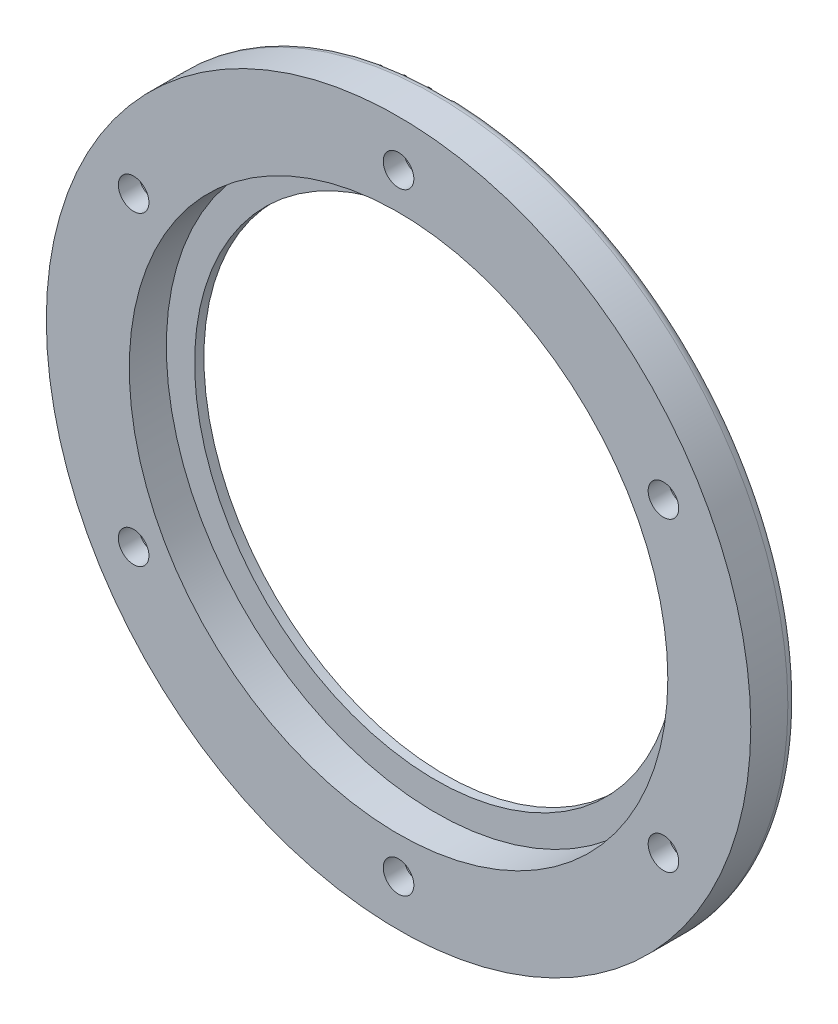
ISO-10303-21;
HEADER;
FILE_DESCRIPTION(('STEP AP214'),'2;1');
FILE_NAME('part.step','',(''),(''),'','','');
FILE_SCHEMA(('AUTOMOTIVE_DESIGN { 1 0 10303 214 1 1 1 1 }'));
ENDSEC;
DATA;
#1=APPLICATION_CONTEXT('core data for automotive mechanical design processes');
#2=APPLICATION_PROTOCOL_DEFINITION('international standard','automotive_design',2000,#1);
#3=PRODUCT_CONTEXT('',#1,'mechanical');
#4=PRODUCT('Part','Part','',(#3));
#5=PRODUCT_RELATED_PRODUCT_CATEGORY('part','',(#4));
#6=PRODUCT_DEFINITION_FORMATION('','',#4);
#7=PRODUCT_DEFINITION_CONTEXT('part definition',#1,'design');
#8=PRODUCT_DEFINITION('design','',#6,#7);
#9=PRODUCT_DEFINITION_SHAPE('','',#8);
#10=(LENGTH_UNIT() NAMED_UNIT(*) SI_UNIT(.MILLI.,.METRE.));
#11=(NAMED_UNIT(*) PLANE_ANGLE_UNIT() SI_UNIT($,.RADIAN.));
#12=(NAMED_UNIT(*) SI_UNIT($,.STERADIAN.) SOLID_ANGLE_UNIT());
#13=UNCERTAINTY_MEASURE_WITH_UNIT(LENGTH_MEASURE(1.E-05),#10,'distance_accuracy_value','');
#14=(GEOMETRIC_REPRESENTATION_CONTEXT(3) GLOBAL_UNCERTAINTY_ASSIGNED_CONTEXT((#13)) GLOBAL_UNIT_ASSIGNED_CONTEXT((#10,
#11,#12)) REPRESENTATION_CONTEXT('',''));
#15=CARTESIAN_POINT('',(0.,0.,0.));
#16=DIRECTION('',(0.,0.,1.));
#17=DIRECTION('',(1.,0.,0.));
#18=AXIS2_PLACEMENT_3D('',#15,#16,#17);
#19=CARTESIAN_POINT('',(28.5788383248865,-16.4999999999999,-24.));
#20=DIRECTION('',(0.,0.,-1.));
#21=DIRECTION('',(-1.,0.,0.));
#22=AXIS2_PLACEMENT_3D('',#19,#20,#21);
#23=CYLINDRICAL_SURFACE('',#22,1.65);
#24=CARTESIAN_POINT('',(28.5788383248865,-16.4999999999999,-24.));
#25=DIRECTION('',(0.,0.,-1.));
#26=DIRECTION('',(-1.,0.,0.));
#27=AXIS2_PLACEMENT_3D('',#24,#25,#26);
#28=CIRCLE('',#27,1.65);
#29=CARTESIAN_POINT('',(26.9288383248865,-16.4999999999999,-24.));
#30=VERTEX_POINT('',#29);
#31=EDGE_CURVE('E97',#30,#30,#28,.T.);
#32=ORIENTED_EDGE('',*,*,#31,.F.);
#33=EDGE_LOOP('',(#32));
#34=FACE_BOUND('',#33,.T.);
#35=CARTESIAN_POINT('',(28.5788383248865,-16.4999999999999,-26.2));
#36=DIRECTION('',(0.,0.,-1.));
#37=DIRECTION('',(-1.,0.,0.));
#38=AXIS2_PLACEMENT_3D('',#35,#36,#37);
#39=CIRCLE('',#38,1.65);
#40=CARTESIAN_POINT('',(26.9288383248865,-16.4999999999999,-26.2));
#41=VERTEX_POINT('',#40);
#42=EDGE_CURVE('E56',#41,#41,#39,.F.);
#43=ORIENTED_EDGE('',*,*,#42,.F.);
#44=EDGE_LOOP('',(#43));
#45=FACE_BOUND('',#44,.T.);
#46=ADVANCED_FACE('F38',(#34,#45),#23,.F.);
#47=CARTESIAN_POINT('',(28.5788383248864,16.5000000000001,-24.));
#48=DIRECTION('',(0.,0.,-1.));
#49=DIRECTION('',(-1.,0.,0.));
#50=AXIS2_PLACEMENT_3D('',#47,#48,#49);
#51=CYLINDRICAL_SURFACE('',#50,1.65);
#52=CARTESIAN_POINT('',(28.5788383248864,16.5000000000001,-24.));
#53=DIRECTION('',(0.,0.,-1.));
#54=DIRECTION('',(-1.,0.,0.));
#55=AXIS2_PLACEMENT_3D('',#52,#53,#54);
#56=CIRCLE('',#55,1.65);
#57=CARTESIAN_POINT('',(26.9288383248864,16.5000000000001,-24.));
#58=VERTEX_POINT('',#57);
#59=EDGE_CURVE('E94',#58,#58,#56,.T.);
#60=ORIENTED_EDGE('',*,*,#59,.F.);
#61=EDGE_LOOP('',(#60));
#62=FACE_BOUND('',#61,.T.);
#63=CARTESIAN_POINT('',(28.5788383248864,16.5000000000001,-26.2));
#64=DIRECTION('',(0.,0.,-1.));
#65=DIRECTION('',(-1.,0.,0.));
#66=AXIS2_PLACEMENT_3D('',#63,#64,#65);
#67=CIRCLE('',#66,1.65);
#68=CARTESIAN_POINT('',(26.9288383248864,16.5000000000001,-26.2));
#69=VERTEX_POINT('',#68);
#70=EDGE_CURVE('E60',#69,#69,#67,.F.);
#71=ORIENTED_EDGE('',*,*,#70,.F.);
#72=EDGE_LOOP('',(#71));
#73=FACE_BOUND('',#72,.T.);
#74=ADVANCED_FACE('F201',(#62,#73),#51,.F.);
#75=CARTESIAN_POINT('',(-2.30437768363647E-13,33.,-24.));
#76=DIRECTION('',(0.,0.,-1.));
#77=DIRECTION('',(-1.,0.,0.));
#78=AXIS2_PLACEMENT_3D('',#75,#76,#77);
#79=CYLINDRICAL_SURFACE('',#78,1.65);
#80=CARTESIAN_POINT('',(-2.30437768363647E-13,33.,-24.));
#81=DIRECTION('',(0.,0.,-1.));
#82=DIRECTION('',(-1.,0.,0.));
#83=AXIS2_PLACEMENT_3D('',#80,#81,#82);
#84=CIRCLE('',#83,1.65);
#85=CARTESIAN_POINT('',(-1.65000000000023,33.,-24.));
#86=VERTEX_POINT('',#85);
#87=EDGE_CURVE('E91',#86,#86,#84,.T.);
#88=ORIENTED_EDGE('',*,*,#87,.F.);
#89=EDGE_LOOP('',(#88));
#90=FACE_BOUND('',#89,.T.);
#91=CARTESIAN_POINT('',(-2.30437768363647E-13,33.,-26.2));
#92=DIRECTION('',(0.,0.,-1.));
#93=DIRECTION('',(-1.,0.,0.));
#94=AXIS2_PLACEMENT_3D('',#91,#92,#93);
#95=CIRCLE('',#94,1.65);
#96=CARTESIAN_POINT('',(-1.65000000000023,33.,-26.2));
#97=VERTEX_POINT('',#96);
#98=EDGE_CURVE('E63',#97,#97,#95,.F.);
#99=ORIENTED_EDGE('',*,*,#98,.F.);
#100=EDGE_LOOP('',(#99));
#101=FACE_BOUND('',#100,.T.);
#102=ADVANCED_FACE('F207',(#90,#101),#79,.F.);
#103=CARTESIAN_POINT('',(-28.5788383248866,16.4999999999997,-24.));
#104=DIRECTION('',(0.,0.,-1.));
#105=DIRECTION('',(-1.,0.,0.));
#106=AXIS2_PLACEMENT_3D('',#103,#104,#105);
#107=CYLINDRICAL_SURFACE('',#106,1.65);
#108=CARTESIAN_POINT('',(-28.5788383248866,16.4999999999997,-24.));
#109=DIRECTION('',(0.,0.,-1.));
#110=DIRECTION('',(-1.,0.,0.));
#111=AXIS2_PLACEMENT_3D('',#108,#109,#110);
#112=CIRCLE('',#111,1.65);
#113=CARTESIAN_POINT('',(-30.2288383248866,16.4999999999997,-24.));
#114=VERTEX_POINT('',#113);
#115=EDGE_CURVE('E88',#114,#114,#112,.T.);
#116=ORIENTED_EDGE('',*,*,#115,.F.);
#117=EDGE_LOOP('',(#116));
#118=FACE_BOUND('',#117,.T.);
#119=CARTESIAN_POINT('',(-28.5788383248866,16.4999999999997,-26.2));
#120=DIRECTION('',(0.,0.,-1.));
#121=DIRECTION('',(-1.,0.,0.));
#122=AXIS2_PLACEMENT_3D('',#119,#120,#121);
#123=CIRCLE('',#122,1.65);
#124=CARTESIAN_POINT('',(-30.2288383248866,16.4999999999997,-26.2));
#125=VERTEX_POINT('',#124);
#126=EDGE_CURVE('E66',#125,#125,#123,.F.);
#127=ORIENTED_EDGE('',*,*,#126,.F.);
#128=EDGE_LOOP('',(#127));
#129=FACE_BOUND('',#128,.T.);
#130=ADVANCED_FACE('F216',(#118,#129),#107,.F.);
#131=CARTESIAN_POINT('',(-28.5788383248863,-16.5000000000003,-24.));
#132=DIRECTION('',(0.,0.,-1.));
#133=DIRECTION('',(-1.,0.,0.));
#134=AXIS2_PLACEMENT_3D('',#131,#132,#133);
#135=CYLINDRICAL_SURFACE('',#134,1.65);
#136=CARTESIAN_POINT('',(-28.5788383248863,-16.5000000000003,-24.));
#137=DIRECTION('',(0.,0.,-1.));
#138=DIRECTION('',(-1.,0.,0.));
#139=AXIS2_PLACEMENT_3D('',#136,#137,#138);
#140=CIRCLE('',#139,1.65);
#141=CARTESIAN_POINT('',(-30.2288383248863,-16.5000000000003,-24.));
#142=VERTEX_POINT('',#141);
#143=EDGE_CURVE('E59',#142,#142,#140,.T.);
#144=ORIENTED_EDGE('',*,*,#143,.F.);
#145=EDGE_LOOP('',(#144));
#146=FACE_BOUND('',#145,.T.);
#147=CARTESIAN_POINT('',(-28.5788383248863,-16.5000000000003,-26.2));
#148=DIRECTION('',(0.,0.,-1.));
#149=DIRECTION('',(-1.,0.,0.));
#150=AXIS2_PLACEMENT_3D('',#147,#148,#149);
#151=CIRCLE('',#150,1.65);
#152=CARTESIAN_POINT('',(-30.2288383248863,-16.5000000000003,-26.2));
#153=VERTEX_POINT('',#152);
#154=EDGE_CURVE('E69',#153,#153,#151,.F.);
#155=ORIENTED_EDGE('',*,*,#154,.F.);
#156=EDGE_LOOP('',(#155));
#157=FACE_BOUND('',#156,.T.);
#158=ADVANCED_FACE('F197',(#146,#157),#135,.F.);
#159=CARTESIAN_POINT('',(0.,-33.,-24.));
#160=DIRECTION('',(0.,0.,-1.));
#161=DIRECTION('',(-1.,0.,0.));
#162=AXIS2_PLACEMENT_3D('',#159,#160,#161);
#163=CYLINDRICAL_SURFACE('',#162,1.65);
#164=CARTESIAN_POINT('',(0.,-33.,-24.));
#165=DIRECTION('',(0.,0.,-1.));
#166=DIRECTION('',(-1.,0.,0.));
#167=AXIS2_PLACEMENT_3D('',#164,#165,#166);
#168=CIRCLE('',#167,1.65);
#169=CARTESIAN_POINT('',(-1.65,-33.,-24.));
#170=VERTEX_POINT('',#169);
#171=EDGE_CURVE('E87',#170,#170,#168,.T.);
#172=ORIENTED_EDGE('',*,*,#171,.F.);
#173=EDGE_LOOP('',(#172));
#174=FACE_BOUND('',#173,.T.);
#175=CARTESIAN_POINT('',(0.,-33.,-26.2));
#176=DIRECTION('',(0.,0.,-1.));
#177=DIRECTION('',(-1.,0.,0.));
#178=AXIS2_PLACEMENT_3D('',#175,#176,#177);
#179=CIRCLE('',#178,1.65);
#180=CARTESIAN_POINT('',(-1.65,-33.,-26.2));
#181=VERTEX_POINT('',#180);
#182=EDGE_CURVE('E72',#181,#181,#179,.F.);
#183=ORIENTED_EDGE('',*,*,#182,.F.);
#184=EDGE_LOOP('',(#183));
#185=FACE_BOUND('',#184,.T.);
#186=ADVANCED_FACE('F193',(#174,#185),#163,.F.);
#187=CARTESIAN_POINT('',(0.,0.,-29.));
#188=DIRECTION('',(0.,0.,1.));
#189=DIRECTION('',(1.,0.,0.));
#190=AXIS2_PLACEMENT_3D('',#187,#188,#189);
#191=CYLINDRICAL_SURFACE('',#190,38.);
#192=CARTESIAN_POINT('',(0.,0.,-28.));
#193=DIRECTION('',(0.,0.,-1.));
#194=DIRECTION('',(-1.,0.,0.));
#195=AXIS2_PLACEMENT_3D('',#192,#193,#194);
#196=CIRCLE('',#195,38.);
#197=CARTESIAN_POINT('',(-38.,0.,-28.));
#198=VERTEX_POINT('',#197);
#199=EDGE_CURVE('E45',#198,#198,#196,.F.);
#200=ORIENTED_EDGE('',*,*,#199,.T.);
#201=EDGE_LOOP('',(#200));
#202=FACE_BOUND('',#201,.T.);
#203=CARTESIAN_POINT('',(0.,0.,-24.));
#204=DIRECTION('',(0.,0.,1.));
#205=DIRECTION('',(1.,0.,0.));
#206=AXIS2_PLACEMENT_3D('',#203,#204,#205);
#207=CIRCLE('',#206,38.);
#208=CARTESIAN_POINT('',(38.,0.,-24.));
#209=VERTEX_POINT('',#208);
#210=EDGE_CURVE('E49',#209,#209,#207,.T.);
#211=ORIENTED_EDGE('',*,*,#210,.F.);
#212=EDGE_LOOP('',(#211));
#213=FACE_BOUND('',#212,.T.);
#214=ADVANCED_FACE('F154',(#202,#213),#191,.T.);
#215=CARTESIAN_POINT('',(38.,0.,-29.));
#216=DIRECTION('',(0.,0.,-1.));
#217=DIRECTION('',(-1.,0.,0.));
#218=AXIS2_PLACEMENT_3D('',#215,#216,#217);
#219=PLANE('',#218);
#220=CARTESIAN_POINT('',(0.,0.,-29.));
#221=DIRECTION('',(0.,0.,-1.));
#222=DIRECTION('',(-1.,0.,0.));
#223=AXIS2_PLACEMENT_3D('',#220,#221,#222);
#224=CIRCLE('',#223,37.);
#225=CARTESIAN_POINT('',(-37.,0.,-29.));
#226=VERTEX_POINT('',#225);
#227=EDGE_CURVE('E10',#226,#226,#224,.T.);
#228=ORIENTED_EDGE('',*,*,#227,.T.);
#229=EDGE_LOOP('',(#228));
#230=FACE_BOUND('',#229,.T.);
#231=CARTESIAN_POINT('',(0.,-33.,-29.));
#232=DIRECTION('',(0.,0.,-1.));
#233=DIRECTION('',(-1.,0.,0.));
#234=AXIS2_PLACEMENT_3D('',#231,#232,#233);
#235=CIRCLE('',#234,3.);
#236=CARTESIAN_POINT('',(-3.,-33.,-29.));
#237=VERTEX_POINT('',#236);
#238=EDGE_CURVE('E129',#237,#237,#235,.T.);
#239=ORIENTED_EDGE('',*,*,#238,.F.);
#240=EDGE_LOOP('',(#239));
#241=FACE_BOUND('',#240,.T.);
#242=CARTESIAN_POINT('',(-28.5788383248863,-16.5000000000003,-29.));
#243=DIRECTION('',(0.,0.,-1.));
#244=DIRECTION('',(-1.,0.,0.));
#245=AXIS2_PLACEMENT_3D('',#242,#243,#244);
#246=CIRCLE('',#245,3.);
#247=CARTESIAN_POINT('',(-31.5788383248863,-16.5000000000003,-29.));
#248=VERTEX_POINT('',#247);
#249=EDGE_CURVE('E108',#248,#248,#246,.T.);
#250=ORIENTED_EDGE('',*,*,#249,.F.);
#251=EDGE_LOOP('',(#250));
#252=FACE_BOUND('',#251,.T.);
#253=CARTESIAN_POINT('',(-28.5788383248866,16.4999999999997,-29.));
#254=DIRECTION('',(0.,0.,-1.));
#255=DIRECTION('',(-1.,0.,0.));
#256=AXIS2_PLACEMENT_3D('',#253,#254,#255);
#257=CIRCLE('',#256,3.);
#258=CARTESIAN_POINT('',(-31.5788383248866,16.4999999999997,-29.));
#259=VERTEX_POINT('',#258);
#260=EDGE_CURVE('E107',#259,#259,#257,.T.);
#261=ORIENTED_EDGE('',*,*,#260,.F.);
#262=EDGE_LOOP('',(#261));
#263=FACE_BOUND('',#262,.T.);
#264=CARTESIAN_POINT('',(-2.30437768363647E-13,33.,-29.));
#265=DIRECTION('',(0.,0.,-1.));
#266=DIRECTION('',(-1.,0.,0.));
#267=AXIS2_PLACEMENT_3D('',#264,#265,#266);
#268=CIRCLE('',#267,3.);
#269=CARTESIAN_POINT('',(-3.00000000000023,33.,-29.));
#270=VERTEX_POINT('',#269);
#271=EDGE_CURVE('E114',#270,#270,#268,.T.);
#272=ORIENTED_EDGE('',*,*,#271,.F.);
#273=EDGE_LOOP('',(#272));
#274=FACE_BOUND('',#273,.T.);
#275=CARTESIAN_POINT('',(28.5788383248864,16.5000000000001,-29.));
#276=DIRECTION('',(0.,0.,-1.));
#277=DIRECTION('',(-1.,0.,0.));
#278=AXIS2_PLACEMENT_3D('',#275,#276,#277);
#279=CIRCLE('',#278,3.);
#280=CARTESIAN_POINT('',(25.5788383248864,16.5000000000001,-29.));
#281=VERTEX_POINT('',#280);
#282=EDGE_CURVE('E120',#281,#281,#279,.T.);
#283=ORIENTED_EDGE('',*,*,#282,.F.);
#284=EDGE_LOOP('',(#283));
#285=FACE_BOUND('',#284,.T.);
#286=CARTESIAN_POINT('',(28.5788383248865,-16.4999999999999,-29.));
#287=DIRECTION('',(0.,0.,-1.));
#288=DIRECTION('',(-1.,0.,0.));
#289=AXIS2_PLACEMENT_3D('',#286,#287,#288);
#290=CIRCLE('',#289,3.);
#291=CARTESIAN_POINT('',(25.5788383248865,-16.4999999999999,-29.));
#292=VERTEX_POINT('',#291);
#293=EDGE_CURVE('E126',#292,#292,#290,.T.);
#294=ORIENTED_EDGE('',*,*,#293,.F.);
#295=EDGE_LOOP('',(#294));
#296=FACE_BOUND('',#295,.T.);
#297=CARTESIAN_POINT('',(0.,0.,-29.));
#298=DIRECTION('',(0.,0.,1.));
#299=DIRECTION('',(1.,0.,0.));
#300=AXIS2_PLACEMENT_3D('',#297,#298,#299);
#301=CIRCLE('',#300,26.);
#302=CARTESIAN_POINT('',(26.,0.,-29.));
#303=VERTEX_POINT('',#302);
#304=EDGE_CURVE('E53',#303,#303,#301,.T.);
#305=ORIENTED_EDGE('',*,*,#304,.T.);
#306=EDGE_LOOP('',(#305));
#307=FACE_BOUND('',#306,.T.);
#308=ADVANCED_FACE('F150',(#230,#241,#252,#263,#274,#285,#296,#307),#219,.T.);
#309=CARTESIAN_POINT('',(0.,0.,-24.));
#310=DIRECTION('',(0.,0.,1.));
#311=DIRECTION('',(1.,0.,0.));
#312=AXIS2_PLACEMENT_3D('',#309,#310,#311);
#313=PLANE('',#312);
#314=ORIENTED_EDGE('',*,*,#171,.T.);
#315=EDGE_LOOP('',(#314));
#316=FACE_BOUND('',#315,.T.);
#317=ORIENTED_EDGE('',*,*,#143,.T.);
#318=EDGE_LOOP('',(#317));
#319=FACE_BOUND('',#318,.T.);
#320=ORIENTED_EDGE('',*,*,#115,.T.);
#321=EDGE_LOOP('',(#320));
#322=FACE_BOUND('',#321,.T.);
#323=ORIENTED_EDGE('',*,*,#87,.T.);
#324=EDGE_LOOP('',(#323));
#325=FACE_BOUND('',#324,.T.);
#326=ORIENTED_EDGE('',*,*,#59,.T.);
#327=EDGE_LOOP('',(#326));
#328=FACE_BOUND('',#327,.T.);
#329=ORIENTED_EDGE('',*,*,#31,.T.);
#330=EDGE_LOOP('',(#329));
#331=FACE_BOUND('',#330,.T.);
#332=CARTESIAN_POINT('',(0.,0.,-24.));
#333=DIRECTION('',(0.,0.,1.));
#334=DIRECTION('',(1.,0.,0.));
#335=AXIS2_PLACEMENT_3D('',#332,#333,#334);
#336=CIRCLE('',#335,29.05);
#337=CARTESIAN_POINT('',(29.05,0.,-24.));
#338=VERTEX_POINT('',#337);
#339=EDGE_CURVE('E84',#338,#338,#336,.T.);
#340=ORIENTED_EDGE('',*,*,#339,.F.);
#341=EDGE_LOOP('',(#340));
#342=FACE_BOUND('',#341,.T.);
#343=ORIENTED_EDGE('',*,*,#210,.T.);
#344=EDGE_LOOP('',(#343));
#345=FACE_BOUND('',#344,.T.);
#346=ADVANCED_FACE('F153',(#316,#319,#322,#325,#328,#331,#342,#345),#313,.T.);
#347=CARTESIAN_POINT('',(0.,0.,-24.));
#348=DIRECTION('',(0.,0.,1.));
#349=DIRECTION('',(1.,0.,0.));
#350=AXIS2_PLACEMENT_3D('',#347,#348,#349);
#351=CYLINDRICAL_SURFACE('',#350,26.);
#352=ORIENTED_EDGE('',*,*,#304,.F.);
#353=EDGE_LOOP('',(#352));
#354=FACE_BOUND('',#353,.T.);
#355=CARTESIAN_POINT('',(0.,0.,-28.));
#356=DIRECTION('',(0.,0.,1.));
#357=DIRECTION('',(1.,0.,0.));
#358=AXIS2_PLACEMENT_3D('',#355,#356,#357);
#359=CIRCLE('',#358,26.);
#360=CARTESIAN_POINT('',(26.,0.,-28.));
#361=VERTEX_POINT('',#360);
#362=EDGE_CURVE('E78',#361,#361,#359,.T.);
#363=ORIENTED_EDGE('',*,*,#362,.T.);
#364=EDGE_LOOP('',(#363));
#365=FACE_BOUND('',#364,.T.);
#366=ADVANCED_FACE('F168',(#354,#365),#351,.F.);
#367=CARTESIAN_POINT('',(26.,0.,-28.));
#368=DIRECTION('',(0.,0.,-1.));
#369=DIRECTION('',(-1.,0.,0.));
#370=AXIS2_PLACEMENT_3D('',#367,#368,#369);
#371=PLANE('',#370);
#372=ORIENTED_EDGE('',*,*,#362,.F.);
#373=EDGE_LOOP('',(#372));
#374=FACE_BOUND('',#373,.T.);
#375=CARTESIAN_POINT('',(0.,0.,-28.));
#376=DIRECTION('',(0.,0.,1.));
#377=DIRECTION('',(1.,0.,0.));
#378=AXIS2_PLACEMENT_3D('',#375,#376,#377);
#379=CIRCLE('',#378,29.05);
#380=CARTESIAN_POINT('',(29.05,0.,-28.));
#381=VERTEX_POINT('',#380);
#382=EDGE_CURVE('E81',#381,#381,#379,.T.);
#383=ORIENTED_EDGE('',*,*,#382,.T.);
#384=EDGE_LOOP('',(#383));
#385=FACE_BOUND('',#384,.T.);
#386=ADVANCED_FACE('F171',(#374,#385),#371,.F.);
#387=CARTESIAN_POINT('',(0.,0.,-24.));
#388=DIRECTION('',(0.,0.,1.));
#389=DIRECTION('',(1.,0.,0.));
#390=AXIS2_PLACEMENT_3D('',#387,#388,#389);
#391=CYLINDRICAL_SURFACE('',#390,29.05);
#392=ORIENTED_EDGE('',*,*,#382,.F.);
#393=EDGE_LOOP('',(#392));
#394=FACE_BOUND('',#393,.T.);
#395=ORIENTED_EDGE('',*,*,#339,.T.);
#396=EDGE_LOOP('',(#395));
#397=FACE_BOUND('',#396,.T.);
#398=ADVANCED_FACE('F177',(#394,#397),#391,.F.);
#399=CARTESIAN_POINT('',(0.,-33.,-26.2));
#400=DIRECTION('',(0.,0.,-1.));
#401=DIRECTION('',(-1.,0.,0.));
#402=AXIS2_PLACEMENT_3D('',#399,#400,#401);
#403=PLANE('',#402);
#404=CARTESIAN_POINT('',(0.,-33.,-26.2));
#405=DIRECTION('',(0.,0.,-1.));
#406=DIRECTION('',(-1.,0.,0.));
#407=AXIS2_PLACEMENT_3D('',#404,#405,#406);
#408=CIRCLE('',#407,3.);
#409=CARTESIAN_POINT('',(-3.,-33.,-26.2));
#410=VERTEX_POINT('',#409);
#411=EDGE_CURVE('E74',#410,#410,#408,.T.);
#412=ORIENTED_EDGE('',*,*,#411,.T.);
#413=EDGE_LOOP('',(#412));
#414=FACE_BOUND('',#413,.T.);
#415=ORIENTED_EDGE('',*,*,#182,.T.);
#416=EDGE_LOOP('',(#415));
#417=FACE_BOUND('',#416,.T.);
#418=ADVANCED_FACE('F140',(#414,#417),#403,.T.);
#419=CARTESIAN_POINT('',(0.,-33.,-26.2));
#420=DIRECTION('',(0.,0.,-1.));
#421=DIRECTION('',(-1.,0.,0.));
#422=AXIS2_PLACEMENT_3D('',#419,#420,#421);
#423=CYLINDRICAL_SURFACE('',#422,3.);
#424=ORIENTED_EDGE('',*,*,#411,.F.);
#425=EDGE_LOOP('',(#424));
#426=FACE_BOUND('',#425,.T.);
#427=ORIENTED_EDGE('',*,*,#238,.T.);
#428=EDGE_LOOP('',(#427));
#429=FACE_BOUND('',#428,.T.);
#430=ADVANCED_FACE('F143',(#426,#429),#423,.F.);
#431=CARTESIAN_POINT('',(-28.5788383248863,-16.5000000000003,-26.2));
#432=DIRECTION('',(0.,0.,-1.));
#433=DIRECTION('',(-1.,0.,0.));
#434=AXIS2_PLACEMENT_3D('',#431,#432,#433);
#435=PLANE('',#434);
#436=CARTESIAN_POINT('',(-28.5788383248863,-16.5000000000003,-26.2));
#437=DIRECTION('',(0.,0.,-1.));
#438=DIRECTION('',(-1.,0.,0.));
#439=AXIS2_PLACEMENT_3D('',#436,#437,#438);
#440=CIRCLE('',#439,3.);
#441=CARTESIAN_POINT('',(-31.5788383248863,-16.5000000000003,-26.2));
#442=VERTEX_POINT('',#441);
#443=EDGE_CURVE('E130',#442,#442,#440,.T.);
#444=ORIENTED_EDGE('',*,*,#443,.T.);
#445=EDGE_LOOP('',(#444));
#446=FACE_BOUND('',#445,.T.);
#447=ORIENTED_EDGE('',*,*,#154,.T.);
#448=EDGE_LOOP('',(#447));
#449=FACE_BOUND('',#448,.T.);
#450=ADVANCED_FACE('F146',(#446,#449),#435,.T.);
#451=CARTESIAN_POINT('',(-28.5788383248863,-16.5000000000003,-26.2));
#452=DIRECTION('',(0.,0.,-1.));
#453=DIRECTION('',(-1.,0.,0.));
#454=AXIS2_PLACEMENT_3D('',#451,#452,#453);
#455=CYLINDRICAL_SURFACE('',#454,3.);
#456=ORIENTED_EDGE('',*,*,#443,.F.);
#457=EDGE_LOOP('',(#456));
#458=FACE_BOUND('',#457,.T.);
#459=ORIENTED_EDGE('',*,*,#249,.T.);
#460=EDGE_LOOP('',(#459));
#461=FACE_BOUND('',#460,.T.);
#462=ADVANCED_FACE('F231',(#458,#461),#455,.F.);
#463=CARTESIAN_POINT('',(-28.5788383248866,16.4999999999997,-26.2));
#464=DIRECTION('',(0.,0.,-1.));
#465=DIRECTION('',(-1.,0.,0.));
#466=AXIS2_PLACEMENT_3D('',#463,#464,#465);
#467=PLANE('',#466);
#468=CARTESIAN_POINT('',(-28.5788383248866,16.4999999999997,-26.2));
#469=DIRECTION('',(0.,0.,-1.));
#470=DIRECTION('',(-1.,0.,0.));
#471=AXIS2_PLACEMENT_3D('',#468,#469,#470);
#472=CIRCLE('',#471,3.);
#473=CARTESIAN_POINT('',(-31.5788383248866,16.4999999999997,-26.2));
#474=VERTEX_POINT('',#473);
#475=EDGE_CURVE('E104',#474,#474,#472,.T.);
#476=ORIENTED_EDGE('',*,*,#475,.T.);
#477=EDGE_LOOP('',(#476));
#478=FACE_BOUND('',#477,.T.);
#479=ORIENTED_EDGE('',*,*,#126,.T.);
#480=EDGE_LOOP('',(#479));
#481=FACE_BOUND('',#480,.T.);
#482=ADVANCED_FACE('F228',(#478,#481),#467,.T.);
#483=CARTESIAN_POINT('',(-28.5788383248866,16.4999999999997,-26.2));
#484=DIRECTION('',(0.,0.,-1.));
#485=DIRECTION('',(-1.,0.,0.));
#486=AXIS2_PLACEMENT_3D('',#483,#484,#485);
#487=CYLINDRICAL_SURFACE('',#486,3.);
#488=ORIENTED_EDGE('',*,*,#475,.F.);
#489=EDGE_LOOP('',(#488));
#490=FACE_BOUND('',#489,.T.);
#491=ORIENTED_EDGE('',*,*,#260,.T.);
#492=EDGE_LOOP('',(#491));
#493=FACE_BOUND('',#492,.T.);
#494=ADVANCED_FACE('F230',(#490,#493),#487,.F.);
#495=CARTESIAN_POINT('',(-2.30437768363647E-13,33.,-26.2));
#496=DIRECTION('',(0.,0.,-1.));
#497=DIRECTION('',(-1.,0.,0.));
#498=AXIS2_PLACEMENT_3D('',#495,#496,#497);
#499=PLANE('',#498);
#500=CARTESIAN_POINT('',(-2.30437768363647E-13,33.,-26.2));
#501=DIRECTION('',(0.,0.,-1.));
#502=DIRECTION('',(-1.,0.,0.));
#503=AXIS2_PLACEMENT_3D('',#500,#501,#502);
#504=CIRCLE('',#503,3.);
#505=CARTESIAN_POINT('',(-3.00000000000023,33.,-26.2));
#506=VERTEX_POINT('',#505);
#507=EDGE_CURVE('E111',#506,#506,#504,.T.);
#508=ORIENTED_EDGE('',*,*,#507,.T.);
#509=EDGE_LOOP('',(#508));
#510=FACE_BOUND('',#509,.T.);
#511=ORIENTED_EDGE('',*,*,#98,.T.);
#512=EDGE_LOOP('',(#511));
#513=FACE_BOUND('',#512,.T.);
#514=ADVANCED_FACE('F238',(#510,#513),#499,.T.);
#515=CARTESIAN_POINT('',(-2.30437768363647E-13,33.,-26.2));
#516=DIRECTION('',(0.,0.,-1.));
#517=DIRECTION('',(-1.,0.,0.));
#518=AXIS2_PLACEMENT_3D('',#515,#516,#517);
#519=CYLINDRICAL_SURFACE('',#518,3.);
#520=ORIENTED_EDGE('',*,*,#507,.F.);
#521=EDGE_LOOP('',(#520));
#522=FACE_BOUND('',#521,.T.);
#523=ORIENTED_EDGE('',*,*,#271,.T.);
#524=EDGE_LOOP('',(#523));
#525=FACE_BOUND('',#524,.T.);
#526=ADVANCED_FACE('F246',(#522,#525),#519,.F.);
#527=CARTESIAN_POINT('',(28.5788383248864,16.5000000000001,-26.2));
#528=DIRECTION('',(0.,0.,-1.));
#529=DIRECTION('',(-1.,0.,0.));
#530=AXIS2_PLACEMENT_3D('',#527,#528,#529);
#531=PLANE('',#530);
#532=CARTESIAN_POINT('',(28.5788383248864,16.5000000000001,-26.2));
#533=DIRECTION('',(0.,0.,-1.));
#534=DIRECTION('',(-1.,0.,0.));
#535=AXIS2_PLACEMENT_3D('',#532,#533,#534);
#536=CIRCLE('',#535,3.);
#537=CARTESIAN_POINT('',(25.5788383248864,16.5000000000001,-26.2));
#538=VERTEX_POINT('',#537);
#539=EDGE_CURVE('E117',#538,#538,#536,.T.);
#540=ORIENTED_EDGE('',*,*,#539,.T.);
#541=EDGE_LOOP('',(#540));
#542=FACE_BOUND('',#541,.T.);
#543=ORIENTED_EDGE('',*,*,#70,.T.);
#544=EDGE_LOOP('',(#543));
#545=FACE_BOUND('',#544,.T.);
#546=ADVANCED_FACE('F250',(#542,#545),#531,.T.);
#547=CARTESIAN_POINT('',(28.5788383248864,16.5000000000001,-26.2));
#548=DIRECTION('',(0.,0.,-1.));
#549=DIRECTION('',(-1.,0.,0.));
#550=AXIS2_PLACEMENT_3D('',#547,#548,#549);
#551=CYLINDRICAL_SURFACE('',#550,3.);
#552=ORIENTED_EDGE('',*,*,#539,.F.);
#553=EDGE_LOOP('',(#552));
#554=FACE_BOUND('',#553,.T.);
#555=ORIENTED_EDGE('',*,*,#282,.T.);
#556=EDGE_LOOP('',(#555));
#557=FACE_BOUND('',#556,.T.);
#558=ADVANCED_FACE('F254',(#554,#557),#551,.F.);
#559=CARTESIAN_POINT('',(28.5788383248865,-16.4999999999999,-26.2));
#560=DIRECTION('',(0.,0.,-1.));
#561=DIRECTION('',(-1.,0.,0.));
#562=AXIS2_PLACEMENT_3D('',#559,#560,#561);
#563=PLANE('',#562);
#564=CARTESIAN_POINT('',(28.5788383248865,-16.4999999999999,-26.2));
#565=DIRECTION('',(0.,0.,-1.));
#566=DIRECTION('',(-1.,0.,0.));
#567=AXIS2_PLACEMENT_3D('',#564,#565,#566);
#568=CIRCLE('',#567,3.);
#569=CARTESIAN_POINT('',(25.5788383248865,-16.4999999999999,-26.2));
#570=VERTEX_POINT('',#569);
#571=EDGE_CURVE('E123',#570,#570,#568,.T.);
#572=ORIENTED_EDGE('',*,*,#571,.T.);
#573=EDGE_LOOP('',(#572));
#574=FACE_BOUND('',#573,.T.);
#575=ORIENTED_EDGE('',*,*,#42,.T.);
#576=EDGE_LOOP('',(#575));
#577=FACE_BOUND('',#576,.T.);
#578=ADVANCED_FACE('F258',(#574,#577),#563,.T.);
#579=CARTESIAN_POINT('',(28.5788383248865,-16.4999999999999,-26.2));
#580=DIRECTION('',(0.,0.,-1.));
#581=DIRECTION('',(-1.,0.,0.));
#582=AXIS2_PLACEMENT_3D('',#579,#580,#581);
#583=CYLINDRICAL_SURFACE('',#582,3.);
#584=ORIENTED_EDGE('',*,*,#571,.F.);
#585=EDGE_LOOP('',(#584));
#586=FACE_BOUND('',#585,.T.);
#587=ORIENTED_EDGE('',*,*,#293,.T.);
#588=EDGE_LOOP('',(#587));
#589=FACE_BOUND('',#588,.T.);
#590=ADVANCED_FACE('F262',(#586,#589),#583,.F.);
#591=CARTESIAN_POINT('',(0.,0.,-28.));
#592=DIRECTION('',(0.,0.,-1.));
#593=DIRECTION('',(-1.,0.,0.));
#594=AXIS2_PLACEMENT_3D('',#591,#592,#593);
#595=TOROIDAL_SURFACE('',#594,37.,1.);
#596=ORIENTED_EDGE('',*,*,#227,.F.);
#597=EDGE_LOOP('',(#596));
#598=FACE_BOUND('',#597,.T.);
#599=ORIENTED_EDGE('',*,*,#199,.F.);
#600=EDGE_LOOP('',(#599));
#601=FACE_BOUND('',#600,.T.);
#602=ADVANCED_FACE('F40',(#598,#601),#595,.T.);
#603=CLOSED_SHELL('',(#46,#74,#102,#130,#158,#186,#214,#308,#346,#366,#386,#398,#418,#430,#450,
#462,#482,#494,#514,#526,#546,#558,#578,#590,#602));
#604=MANIFOLD_SOLID_BREP('B2',#603);
#605=ADVANCED_BREP_SHAPE_REPRESENTATION('',(#18,#604),#14);
#606=SHAPE_DEFINITION_REPRESENTATION(#9,#605);
ENDSEC;
END-ISO-10303-21;
